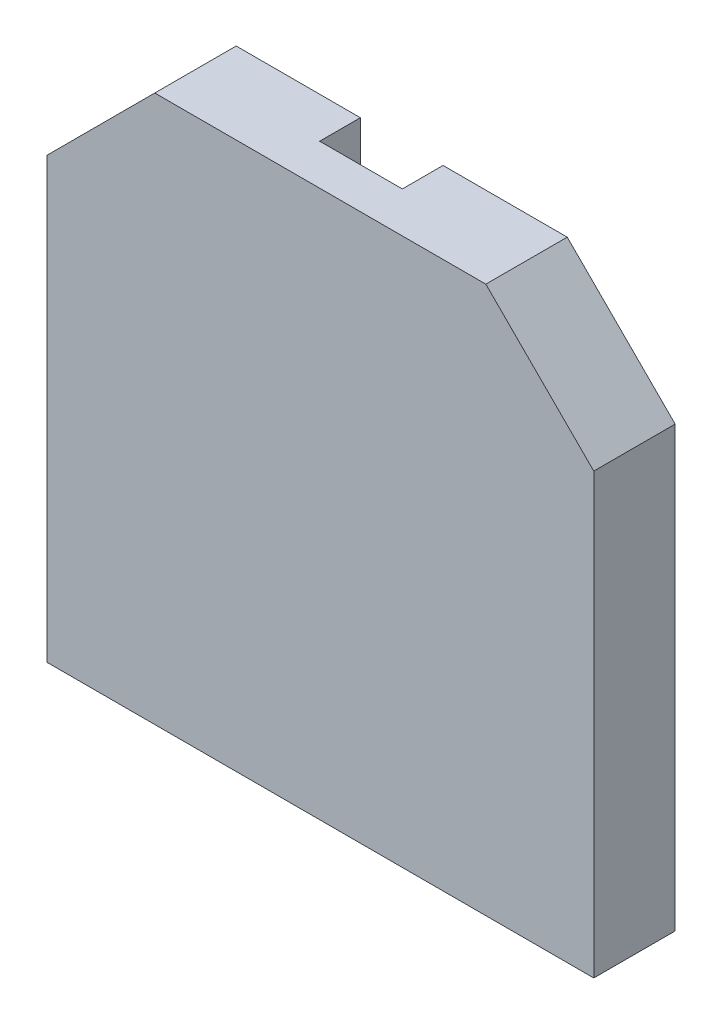
ISO-10303-21;
HEADER;
FILE_DESCRIPTION(('STEP AP214'),'2;1');
FILE_NAME('part.step','',(''),(''),'','','');
FILE_SCHEMA(('AUTOMOTIVE_DESIGN { 1 0 10303 214 1 1 1 1 }'));
ENDSEC;
DATA;
#1=APPLICATION_CONTEXT('core data for automotive mechanical design processes');
#2=APPLICATION_PROTOCOL_DEFINITION('international standard','automotive_design',2000,#1);
#3=PRODUCT_CONTEXT('',#1,'mechanical');
#4=PRODUCT('Part','Part','',(#3));
#5=PRODUCT_RELATED_PRODUCT_CATEGORY('part','',(#4));
#6=PRODUCT_DEFINITION_FORMATION('','',#4);
#7=PRODUCT_DEFINITION_CONTEXT('part definition',#1,'design');
#8=PRODUCT_DEFINITION('design','',#6,#7);
#9=PRODUCT_DEFINITION_SHAPE('','',#8);
#10=(LENGTH_UNIT() NAMED_UNIT(*) SI_UNIT(.MILLI.,.METRE.));
#11=(NAMED_UNIT(*) PLANE_ANGLE_UNIT() SI_UNIT($,.RADIAN.));
#12=(NAMED_UNIT(*) SI_UNIT($,.STERADIAN.) SOLID_ANGLE_UNIT());
#13=UNCERTAINTY_MEASURE_WITH_UNIT(LENGTH_MEASURE(1.E-05),#10,'distance_accuracy_value','');
#14=(GEOMETRIC_REPRESENTATION_CONTEXT(3) GLOBAL_UNCERTAINTY_ASSIGNED_CONTEXT((#13)) GLOBAL_UNIT_ASSIGNED_CONTEXT((#10,
#11,#12)) REPRESENTATION_CONTEXT('',''));
#15=CARTESIAN_POINT('',(0.,0.,0.));
#16=DIRECTION('',(0.,0.,1.));
#17=DIRECTION('',(1.,0.,0.));
#18=AXIS2_PLACEMENT_3D('',#15,#16,#17);
#19=CARTESIAN_POINT('',(-0.32500062,-2.34697524,0.31999936));
#20=DIRECTION('',(0.,0.,-1.));
#21=DIRECTION('',(-1.,0.,0.));
#22=AXIS2_PLACEMENT_3D('',#19,#20,#21);
#23=PLANE('',#22);
#24=DIRECTION('',(0.,1.,0.));
#25=VECTOR('',#24,1.);
#26=CARTESIAN_POINT('',(0.32500062,-4.14280096,0.31999936));
#27=LINE('',#26,#25);
#28=CARTESIAN_POINT('',(0.32500062,-3.9928038,0.31999936));
#29=VERTEX_POINT('',#28);
#30=CARTESIAN_POINT('',(0.32500062,-2.34697524,0.31999936));
#31=VERTEX_POINT('',#30);
#32=EDGE_CURVE('E116',#29,#31,#27,.T.);
#33=ORIENTED_EDGE('',*,*,#32,.F.);
#34=DIRECTION('',(-1.,0.,0.));
#35=VECTOR('',#34,1.);
#36=CARTESIAN_POINT('',(-0.32500062,-3.9928038,0.31999936));
#37=LINE('',#36,#35);
#38=CARTESIAN_POINT('',(-0.32500062,-3.9928038,0.31999936));
#39=VERTEX_POINT('',#38);
#40=EDGE_CURVE('E20',#29,#39,#37,.T.);
#41=ORIENTED_EDGE('',*,*,#40,.T.);
#42=DIRECTION('',(0.,1.,0.));
#43=VECTOR('',#42,1.);
#44=CARTESIAN_POINT('',(-0.32500062,-2.34697524,0.31999936));
#45=LINE('',#44,#43);
#46=CARTESIAN_POINT('',(-0.32500062,-2.34697524,0.31999936));
#47=VERTEX_POINT('',#46);
#48=EDGE_CURVE('E143',#47,#39,#45,.F.);
#49=ORIENTED_EDGE('',*,*,#48,.F.);
#50=DIRECTION('',(1.,0.,0.));
#51=VECTOR('',#50,1.);
#52=CARTESIAN_POINT('',(0.32500062,-2.34697524,0.31999936));
#53=LINE('',#52,#51);
#54=EDGE_CURVE('E132',#31,#47,#53,.F.);
#55=ORIENTED_EDGE('',*,*,#54,.F.);
#56=EDGE_LOOP('',(#33,#41,#49,#55));
#57=FACE_BOUND('',#56,.T.);
#58=ADVANCED_FACE('F17',(#57),#23,.T.);
#59=CARTESIAN_POINT('',(-0.32500062,0.45719746,0.31999936));
#60=DIRECTION('',(0.,0.,-1.));
#61=DIRECTION('',(-1.,0.,0.));
#62=AXIS2_PLACEMENT_3D('',#59,#60,#61);
#63=PLANE('',#62);
#64=DIRECTION('',(0.,1.,0.));
#65=VECTOR('',#64,1.);
#66=CARTESIAN_POINT('',(-0.32500062,0.45719746,0.31999936));
#67=LINE('',#66,#65);
#68=CARTESIAN_POINT('',(-0.32500062,0.30719776,0.31999936));
#69=VERTEX_POINT('',#68);
#70=CARTESIAN_POINT('',(-0.32500062,-1.33862826,0.31999936));
#71=VERTEX_POINT('',#70);
#72=EDGE_CURVE('E146',#69,#71,#67,.F.);
#73=ORIENTED_EDGE('',*,*,#72,.F.);
#74=DIRECTION('',(-1.,0.,0.));
#75=VECTOR('',#74,1.);
#76=CARTESIAN_POINT('',(-0.32500062,0.30719776,0.31999936));
#77=LINE('',#76,#75);
#78=CARTESIAN_POINT('',(0.32500062,0.30719776,0.31999936));
#79=VERTEX_POINT('',#78);
#80=EDGE_CURVE('E128',#69,#79,#77,.F.);
#81=ORIENTED_EDGE('',*,*,#80,.T.);
#82=DIRECTION('',(0.,1.,0.));
#83=VECTOR('',#82,1.);
#84=CARTESIAN_POINT('',(0.32500062,-1.33862826,0.31999936));
#85=LINE('',#84,#83);
#86=CARTESIAN_POINT('',(0.32500062,-1.33862826,0.31999936));
#87=VERTEX_POINT('',#86);
#88=EDGE_CURVE('E159',#87,#79,#85,.T.);
#89=ORIENTED_EDGE('',*,*,#88,.F.);
#90=DIRECTION('',(1.,0.,0.));
#91=VECTOR('',#90,1.);
#92=CARTESIAN_POINT('',(-0.32500062,-1.33862826,0.31999936));
#93=LINE('',#92,#91);
#94=EDGE_CURVE('E151',#71,#87,#93,.T.);
#95=ORIENTED_EDGE('',*,*,#94,.F.);
#96=EDGE_LOOP('',(#73,#81,#89,#95));
#97=FACE_BOUND('',#96,.T.);
#98=ADVANCED_FACE('F265',(#97),#63,.T.);
#99=CARTESIAN_POINT('',(0.32500062,-4.14280096,-1.00000054));
#100=DIRECTION('',(-1.,0.,0.));
#101=DIRECTION('',(0.,0.,1.));
#102=AXIS2_PLACEMENT_3D('',#99,#100,#101);
#103=PLANE('',#102);
#104=DIRECTION('',(0.,1.,0.));
#105=VECTOR('',#104,1.);
#106=CARTESIAN_POINT('',(0.32500062,-0.54133242,0.));
#107=LINE('',#106,#105);
#108=CARTESIAN_POINT('',(0.32500062,-3.9928038,0.));
#109=VERTEX_POINT('',#108);
#110=CARTESIAN_POINT('',(0.32500062,-2.34697524,0.));
#111=VERTEX_POINT('',#110);
#112=EDGE_CURVE('E130',#109,#111,#107,.T.);
#113=ORIENTED_EDGE('',*,*,#112,.F.);
#114=DIRECTION('',(0.,0.,1.));
#115=VECTOR('',#114,1.);
#116=CARTESIAN_POINT('',(0.32500062,-3.9928038,-1.00000054));
#117=LINE('',#116,#115);
#118=EDGE_CURVE('E121',#109,#29,#117,.T.);
#119=ORIENTED_EDGE('',*,*,#118,.T.);
#120=ORIENTED_EDGE('',*,*,#32,.T.);
#121=DIRECTION('',(0.,0.,-1.));
#122=VECTOR('',#121,1.);
#123=CARTESIAN_POINT('',(0.32500062,-2.34697524,-1.00000054));
#124=LINE('',#123,#122);
#125=EDGE_CURVE('E138',#111,#31,#124,.F.);
#126=ORIENTED_EDGE('',*,*,#125,.F.);
#127=EDGE_LOOP('',(#113,#119,#120,#126));
#128=FACE_BOUND('',#127,.T.);
#129=ADVANCED_FACE('F129',(#128),#103,.T.);
#130=CARTESIAN_POINT('',(0.32500062,-2.34697524,-1.00000054));
#131=DIRECTION('',(0.,-1.,0.));
#132=DIRECTION('',(0.,0.,-1.));
#133=AXIS2_PLACEMENT_3D('',#130,#131,#132);
#134=PLANE('',#133);
#135=DIRECTION('',(-1.,0.,0.));
#136=VECTOR('',#135,1.);
#137=CARTESIAN_POINT('',(-2.15000078,-2.34697524,0.));
#138=LINE('',#137,#136);
#139=CARTESIAN_POINT('',(-0.32500062,-2.34697524,0.));
#140=VERTEX_POINT('',#139);
#141=EDGE_CURVE('E165',#111,#140,#138,.T.);
#142=ORIENTED_EDGE('',*,*,#141,.F.);
#143=ORIENTED_EDGE('',*,*,#125,.T.);
#144=ORIENTED_EDGE('',*,*,#54,.T.);
#145=DIRECTION('',(0.,0.,-1.));
#146=VECTOR('',#145,1.);
#147=CARTESIAN_POINT('',(-0.32500062,-2.34697524,-1.00000054));
#148=LINE('',#147,#146);
#149=EDGE_CURVE('E140',#140,#47,#148,.F.);
#150=ORIENTED_EDGE('',*,*,#149,.F.);
#151=EDGE_LOOP('',(#142,#143,#144,#150));
#152=FACE_BOUND('',#151,.T.);
#153=ADVANCED_FACE('F255',(#152),#134,.T.);
#154=CARTESIAN_POINT('',(-0.32500062,-2.34697524,-1.00000054));
#155=DIRECTION('',(1.,0.,0.));
#156=DIRECTION('',(0.,0.,-1.));
#157=AXIS2_PLACEMENT_3D('',#154,#155,#156);
#158=PLANE('',#157);
#159=ORIENTED_EDGE('',*,*,#48,.T.);
#160=DIRECTION('',(0.,0.,-1.));
#161=VECTOR('',#160,1.);
#162=CARTESIAN_POINT('',(-0.32500062,-3.9928038,-1.00000054));
#163=LINE('',#162,#161);
#164=CARTESIAN_POINT('',(-0.32500062,-3.9928038,0.));
#165=VERTEX_POINT('',#164);
#166=EDGE_CURVE('E124',#39,#165,#163,.T.);
#167=ORIENTED_EDGE('',*,*,#166,.T.);
#168=DIRECTION('',(0.,1.,0.));
#169=VECTOR('',#168,1.);
#170=CARTESIAN_POINT('',(-0.32500062,-0.54133242,0.));
#171=LINE('',#170,#169);
#172=EDGE_CURVE('E167',#140,#165,#171,.F.);
#173=ORIENTED_EDGE('',*,*,#172,.F.);
#174=ORIENTED_EDGE('',*,*,#149,.T.);
#175=EDGE_LOOP('',(#159,#167,#173,#174));
#176=FACE_BOUND('',#175,.T.);
#177=ADVANCED_FACE('F253',(#176),#158,.T.);
#178=CARTESIAN_POINT('',(-0.32500062,0.45719746,-1.00000054));
#179=DIRECTION('',(1.,0.,0.));
#180=DIRECTION('',(0.,0.,-1.));
#181=AXIS2_PLACEMENT_3D('',#178,#179,#180);
#182=PLANE('',#181);
#183=DIRECTION('',(0.,1.,0.));
#184=VECTOR('',#183,1.);
#185=CARTESIAN_POINT('',(-0.32500062,-0.54133242,0.));
#186=LINE('',#185,#184);
#187=CARTESIAN_POINT('',(-0.32500062,0.30719776,0.));
#188=VERTEX_POINT('',#187);
#189=CARTESIAN_POINT('',(-0.32500062,-1.33862826,0.));
#190=VERTEX_POINT('',#189);
#191=EDGE_CURVE('E170',#188,#190,#186,.F.);
#192=ORIENTED_EDGE('',*,*,#191,.F.);
#193=DIRECTION('',(0.,0.,-1.));
#194=VECTOR('',#193,1.);
#195=CARTESIAN_POINT('',(-0.32500062,0.30719776,-1.00000054));
#196=LINE('',#195,#194);
#197=EDGE_CURVE('E148',#188,#69,#196,.F.);
#198=ORIENTED_EDGE('',*,*,#197,.T.);
#199=ORIENTED_EDGE('',*,*,#72,.T.);
#200=DIRECTION('',(0.,0.,1.));
#201=VECTOR('',#200,1.);
#202=CARTESIAN_POINT('',(-0.32500062,-1.33862826,-1.00000054));
#203=LINE('',#202,#201);
#204=EDGE_CURVE('E153',#190,#71,#203,.T.);
#205=ORIENTED_EDGE('',*,*,#204,.F.);
#206=EDGE_LOOP('',(#192,#198,#199,#205));
#207=FACE_BOUND('',#206,.T.);
#208=ADVANCED_FACE('F263',(#207),#182,.T.);
#209=CARTESIAN_POINT('',(-0.32500062,-1.33862826,-1.00000054));
#210=DIRECTION('',(0.,1.,0.));
#211=DIRECTION('',(0.,0.,1.));
#212=AXIS2_PLACEMENT_3D('',#209,#210,#211);
#213=PLANE('',#212);
#214=DIRECTION('',(-1.,0.,0.));
#215=VECTOR('',#214,1.);
#216=CARTESIAN_POINT('',(-2.15000078,-1.33862826,0.));
#217=LINE('',#216,#215);
#218=CARTESIAN_POINT('',(0.32500062,-1.33862826,0.));
#219=VERTEX_POINT('',#218);
#220=EDGE_CURVE('E172',#190,#219,#217,.F.);
#221=ORIENTED_EDGE('',*,*,#220,.F.);
#222=ORIENTED_EDGE('',*,*,#204,.T.);
#223=ORIENTED_EDGE('',*,*,#94,.T.);
#224=DIRECTION('',(0.,0.,1.));
#225=VECTOR('',#224,1.);
#226=CARTESIAN_POINT('',(0.32500062,-1.33862826,-1.00000054));
#227=LINE('',#226,#225);
#228=EDGE_CURVE('E156',#219,#87,#227,.T.);
#229=ORIENTED_EDGE('',*,*,#228,.F.);
#230=EDGE_LOOP('',(#221,#222,#223,#229));
#231=FACE_BOUND('',#230,.T.);
#232=ADVANCED_FACE('F289',(#231),#213,.T.);
#233=CARTESIAN_POINT('',(0.32500062,-1.33862826,-1.00000054));
#234=DIRECTION('',(-1.,0.,0.));
#235=DIRECTION('',(0.,0.,1.));
#236=AXIS2_PLACEMENT_3D('',#233,#234,#235);
#237=PLANE('',#236);
#238=ORIENTED_EDGE('',*,*,#88,.T.);
#239=DIRECTION('',(0.,0.,1.));
#240=VECTOR('',#239,1.);
#241=CARTESIAN_POINT('',(0.32500062,0.30719776,-1.00000054));
#242=LINE('',#241,#240);
#243=CARTESIAN_POINT('',(0.32500062,0.30719776,0.));
#244=VERTEX_POINT('',#243);
#245=EDGE_CURVE('E162',#79,#244,#242,.F.);
#246=ORIENTED_EDGE('',*,*,#245,.T.);
#247=DIRECTION('',(0.,1.,0.));
#248=VECTOR('',#247,1.);
#249=CARTESIAN_POINT('',(0.32500062,-0.54133242,0.));
#250=LINE('',#249,#248);
#251=EDGE_CURVE('E174',#219,#244,#250,.T.);
#252=ORIENTED_EDGE('',*,*,#251,.F.);
#253=ORIENTED_EDGE('',*,*,#228,.T.);
#254=EDGE_LOOP('',(#238,#246,#252,#253));
#255=FACE_BOUND('',#254,.T.);
#256=ADVANCED_FACE('F286',(#255),#237,.T.);
#257=CARTESIAN_POINT('',(-2.15000078,-0.54133242,0.));
#258=DIRECTION('',(0.,0.,-1.));
#259=DIRECTION('',(-1.,0.,0.));
#260=AXIS2_PLACEMENT_3D('',#257,#258,#259);
#261=PLANE('',#260);
#262=DIRECTION('',(0.707106781186548,-0.707106781186548,0.));
#263=VECTOR('',#262,1.);
#264=CARTESIAN_POINT('',(2.15000078,-0.54133242,0.));
#265=LINE('',#264,#263);
#266=CARTESIAN_POINT('',(1.3014706,0.30719776,0.));
#267=VERTEX_POINT('',#266);
#268=CARTESIAN_POINT('',(2.15000078,-0.54133242,0.));
#269=VERTEX_POINT('',#268);
#270=EDGE_CURVE('E194',#267,#269,#265,.T.);
#271=ORIENTED_EDGE('',*,*,#270,.T.);
#272=DIRECTION('',(0.,1.,0.));
#273=VECTOR('',#272,1.);
#274=CARTESIAN_POINT('',(2.15000078,-3.9928038,0.));
#275=LINE('',#274,#273);
#276=CARTESIAN_POINT('',(2.15000078,-3.9928038,0.));
#277=VERTEX_POINT('',#276);
#278=EDGE_CURVE('E200',#269,#277,#275,.F.);
#279=ORIENTED_EDGE('',*,*,#278,.T.);
#280=DIRECTION('',(1.,0.,0.));
#281=VECTOR('',#280,1.);
#282=CARTESIAN_POINT('',(-2.15000078,-3.9928038,0.));
#283=LINE('',#282,#281);
#284=EDGE_CURVE('E212',#277,#109,#283,.F.);
#285=ORIENTED_EDGE('',*,*,#284,.T.);
#286=ORIENTED_EDGE('',*,*,#112,.T.);
#287=ORIENTED_EDGE('',*,*,#141,.T.);
#288=ORIENTED_EDGE('',*,*,#172,.T.);
#289=DIRECTION('',(1.,0.,0.));
#290=VECTOR('',#289,1.);
#291=CARTESIAN_POINT('',(-2.15000078,-3.9928038,0.));
#292=LINE('',#291,#290);
#293=CARTESIAN_POINT('',(-2.15000078,-3.9928038,0.));
#294=VERTEX_POINT('',#293);
#295=EDGE_CURVE('E205',#165,#294,#292,.F.);
#296=ORIENTED_EDGE('',*,*,#295,.T.);
#297=DIRECTION('',(0.,1.,0.));
#298=VECTOR('',#297,1.);
#299=CARTESIAN_POINT('',(-2.15000078,-0.54133242,0.));
#300=LINE('',#299,#298);
#301=CARTESIAN_POINT('',(-2.15000078,-0.54133242,0.));
#302=VERTEX_POINT('',#301);
#303=EDGE_CURVE('E177',#294,#302,#300,.T.);
#304=ORIENTED_EDGE('',*,*,#303,.T.);
#305=DIRECTION('',(0.707106781186548,0.707106781186548,0.));
#306=VECTOR('',#305,1.);
#307=CARTESIAN_POINT('',(-1.3014706,0.30719776,0.));
#308=LINE('',#307,#306);
#309=CARTESIAN_POINT('',(-1.3014706,0.30719776,0.));
#310=VERTEX_POINT('',#309);
#311=EDGE_CURVE('E180',#302,#310,#308,.T.);
#312=ORIENTED_EDGE('',*,*,#311,.T.);
#313=DIRECTION('',(1.,0.,0.));
#314=VECTOR('',#313,1.);
#315=CARTESIAN_POINT('',(1.3014706,0.30719776,0.));
#316=LINE('',#315,#314);
#317=EDGE_CURVE('E188',#310,#188,#316,.T.);
#318=ORIENTED_EDGE('',*,*,#317,.T.);
#319=ORIENTED_EDGE('',*,*,#191,.T.);
#320=ORIENTED_EDGE('',*,*,#220,.T.);
#321=ORIENTED_EDGE('',*,*,#251,.T.);
#322=DIRECTION('',(1.,0.,0.));
#323=VECTOR('',#322,1.);
#324=CARTESIAN_POINT('',(1.3014706,0.30719776,0.));
#325=LINE('',#324,#323);
#326=EDGE_CURVE('E191',#244,#267,#325,.T.);
#327=ORIENTED_EDGE('',*,*,#326,.T.);
#328=EDGE_LOOP('',(#271,#279,#285,#286,#287,#288,#296,#304,#312,#318,#319,#320,#321,#327));
#329=FACE_BOUND('',#328,.T.);
#330=ADVANCED_FACE('F248',(#329),#261,.T.);
#331=CARTESIAN_POINT('',(-2.15000078,-0.54133242,0.));
#332=DIRECTION('',(1.,0.,0.));
#333=DIRECTION('',(0.,0.,-1.));
#334=AXIS2_PLACEMENT_3D('',#331,#332,#333);
#335=PLANE('',#334);
#336=DIRECTION('',(0.,1.,0.));
#337=VECTOR('',#336,1.);
#338=CARTESIAN_POINT('',(-2.15000078,-0.54133242,0.64000126));
#339=LINE('',#338,#337);
#340=CARTESIAN_POINT('',(-2.15000078,-3.9928038,0.64000126));
#341=VERTEX_POINT('',#340);
#342=CARTESIAN_POINT('',(-2.15000078,-0.54133242,0.64000126));
#343=VERTEX_POINT('',#342);
#344=EDGE_CURVE('E214',#341,#343,#339,.T.);
#345=ORIENTED_EDGE('',*,*,#344,.T.);
#346=DIRECTION('',(0.,0.,1.));
#347=VECTOR('',#346,1.);
#348=CARTESIAN_POINT('',(-2.15000078,-0.54133242,0.));
#349=LINE('',#348,#347);
#350=EDGE_CURVE('E182',#343,#302,#349,.F.);
#351=ORIENTED_EDGE('',*,*,#350,.T.);
#352=ORIENTED_EDGE('',*,*,#303,.F.);
#353=DIRECTION('',(0.,0.,1.));
#354=VECTOR('',#353,1.);
#355=CARTESIAN_POINT('',(-2.15000078,-3.9928038,0.));
#356=LINE('',#355,#354);
#357=EDGE_CURVE('E208',#294,#341,#356,.T.);
#358=ORIENTED_EDGE('',*,*,#357,.T.);
#359=EDGE_LOOP('',(#345,#351,#352,#358));
#360=FACE_BOUND('',#359,.T.);
#361=ADVANCED_FACE('F245',(#360),#335,.F.);
#362=CARTESIAN_POINT('',(-1.3014706,0.30719776,0.));
#363=DIRECTION('',(0.707106781186548,-0.707106781186548,0.));
#364=DIRECTION('',(0.707106781186548,0.707106781186548,0.));
#365=AXIS2_PLACEMENT_3D('',#362,#363,#364);
#366=PLANE('',#365);
#367=DIRECTION('',(0.707106781186547,0.707106781186548,0.));
#368=VECTOR('',#367,1.);
#369=CARTESIAN_POINT('',(-2.15000078,-0.54133242,0.64000126));
#370=LINE('',#369,#368);
#371=CARTESIAN_POINT('',(-1.3014706,0.30719776,0.64000126));
#372=VERTEX_POINT('',#371);
#373=EDGE_CURVE('E217',#343,#372,#370,.T.);
#374=ORIENTED_EDGE('',*,*,#373,.T.);
#375=DIRECTION('',(0.,0.,-1.));
#376=VECTOR('',#375,1.);
#377=CARTESIAN_POINT('',(-1.3014706,0.30719776,0.));
#378=LINE('',#377,#376);
#379=EDGE_CURVE('E185',#372,#310,#378,.T.);
#380=ORIENTED_EDGE('',*,*,#379,.T.);
#381=ORIENTED_EDGE('',*,*,#311,.F.);
#382=ORIENTED_EDGE('',*,*,#350,.F.);
#383=EDGE_LOOP('',(#374,#380,#381,#382));
#384=FACE_BOUND('',#383,.T.);
#385=ADVANCED_FACE('F243',(#384),#366,.F.);
#386=CARTESIAN_POINT('',(1.3014706,0.30719776,0.));
#387=DIRECTION('',(0.,-1.,0.));
#388=DIRECTION('',(0.,0.,-1.));
#389=AXIS2_PLACEMENT_3D('',#386,#387,#388);
#390=PLANE('',#389);
#391=DIRECTION('',(0.,0.,1.));
#392=VECTOR('',#391,1.);
#393=CARTESIAN_POINT('',(1.3014706,0.30719776,0.));
#394=LINE('',#393,#392);
#395=CARTESIAN_POINT('',(1.3014706,0.30719776,0.64000126));
#396=VERTEX_POINT('',#395);
#397=EDGE_CURVE('E197',#396,#267,#394,.F.);
#398=ORIENTED_EDGE('',*,*,#397,.T.);
#399=ORIENTED_EDGE('',*,*,#326,.F.);
#400=ORIENTED_EDGE('',*,*,#245,.F.);
#401=ORIENTED_EDGE('',*,*,#80,.F.);
#402=ORIENTED_EDGE('',*,*,#197,.F.);
#403=ORIENTED_EDGE('',*,*,#317,.F.);
#404=ORIENTED_EDGE('',*,*,#379,.F.);
#405=DIRECTION('',(-1.,0.,0.));
#406=VECTOR('',#405,1.);
#407=CARTESIAN_POINT('',(-2.15000078,0.30719776,0.64000126));
#408=LINE('',#407,#406);
#409=EDGE_CURVE('E220',#372,#396,#408,.F.);
#410=ORIENTED_EDGE('',*,*,#409,.T.);
#411=EDGE_LOOP('',(#398,#399,#400,#401,#402,#403,#404,#410));
#412=FACE_BOUND('',#411,.T.);
#413=ADVANCED_FACE('F238',(#412),#390,.F.);
#414=CARTESIAN_POINT('',(2.15000078,-0.54133242,0.));
#415=DIRECTION('',(-0.707106781186548,-0.707106781186548,0.));
#416=DIRECTION('',(0.707106781186548,-0.707106781186548,0.));
#417=AXIS2_PLACEMENT_3D('',#414,#415,#416);
#418=PLANE('',#417);
#419=DIRECTION('',(0.707106781186547,-0.707106781186548,0.));
#420=VECTOR('',#419,1.);
#421=CARTESIAN_POINT('',(1.3014706,0.30719776,0.64000126));
#422=LINE('',#421,#420);
#423=CARTESIAN_POINT('',(2.15000078,-0.54133242,0.64000126));
#424=VERTEX_POINT('',#423);
#425=EDGE_CURVE('E223',#396,#424,#422,.T.);
#426=ORIENTED_EDGE('',*,*,#425,.T.);
#427=DIRECTION('',(0.,0.,1.));
#428=VECTOR('',#427,1.);
#429=CARTESIAN_POINT('',(2.15000078,-0.54133242,0.));
#430=LINE('',#429,#428);
#431=EDGE_CURVE('E202',#424,#269,#430,.F.);
#432=ORIENTED_EDGE('',*,*,#431,.T.);
#433=ORIENTED_EDGE('',*,*,#270,.F.);
#434=ORIENTED_EDGE('',*,*,#397,.F.);
#435=EDGE_LOOP('',(#426,#432,#433,#434));
#436=FACE_BOUND('',#435,.T.);
#437=ADVANCED_FACE('F235',(#436),#418,.F.);
#438=CARTESIAN_POINT('',(2.15000078,-3.9928038,0.));
#439=DIRECTION('',(-1.,0.,0.));
#440=DIRECTION('',(0.,0.,1.));
#441=AXIS2_PLACEMENT_3D('',#438,#439,#440);
#442=PLANE('',#441);
#443=DIRECTION('',(0.,1.,0.));
#444=VECTOR('',#443,1.);
#445=CARTESIAN_POINT('',(2.15000078,-0.54133242,0.64000126));
#446=LINE('',#445,#444);
#447=CARTESIAN_POINT('',(2.15000078,-3.9928038,0.64000126));
#448=VERTEX_POINT('',#447);
#449=EDGE_CURVE('E26',#424,#448,#446,.F.);
#450=ORIENTED_EDGE('',*,*,#449,.T.);
#451=DIRECTION('',(0.,0.,1.));
#452=VECTOR('',#451,1.);
#453=CARTESIAN_POINT('',(2.15000078,-3.9928038,0.));
#454=LINE('',#453,#452);
#455=EDGE_CURVE('E34',#448,#277,#454,.F.);
#456=ORIENTED_EDGE('',*,*,#455,.T.);
#457=ORIENTED_EDGE('',*,*,#278,.F.);
#458=ORIENTED_EDGE('',*,*,#431,.F.);
#459=EDGE_LOOP('',(#450,#456,#457,#458));
#460=FACE_BOUND('',#459,.T.);
#461=ADVANCED_FACE('F229',(#460),#442,.F.);
#462=CARTESIAN_POINT('',(-2.15000078,-3.9928038,0.));
#463=DIRECTION('',(0.,1.,0.));
#464=DIRECTION('',(0.,0.,1.));
#465=AXIS2_PLACEMENT_3D('',#462,#463,#464);
#466=PLANE('',#465);
#467=ORIENTED_EDGE('',*,*,#455,.F.);
#468=DIRECTION('',(-1.,0.,0.));
#469=VECTOR('',#468,1.);
#470=CARTESIAN_POINT('',(-2.15000078,-3.9928038,0.64000126));
#471=LINE('',#470,#469);
#472=EDGE_CURVE('E11',#448,#341,#471,.T.);
#473=ORIENTED_EDGE('',*,*,#472,.T.);
#474=ORIENTED_EDGE('',*,*,#357,.F.);
#475=ORIENTED_EDGE('',*,*,#295,.F.);
#476=ORIENTED_EDGE('',*,*,#166,.F.);
#477=ORIENTED_EDGE('',*,*,#40,.F.);
#478=ORIENTED_EDGE('',*,*,#118,.F.);
#479=ORIENTED_EDGE('',*,*,#284,.F.);
#480=EDGE_LOOP('',(#467,#473,#474,#475,#476,#477,#478,#479));
#481=FACE_BOUND('',#480,.T.);
#482=ADVANCED_FACE('F120',(#481),#466,.F.);
#483=CARTESIAN_POINT('',(-2.15000078,-0.54133242,0.64000126));
#484=DIRECTION('',(0.,0.,-1.));
#485=DIRECTION('',(-1.,0.,0.));
#486=AXIS2_PLACEMENT_3D('',#483,#484,#485);
#487=PLANE('',#486);
#488=ORIENTED_EDGE('',*,*,#449,.F.);
#489=ORIENTED_EDGE('',*,*,#425,.F.);
#490=ORIENTED_EDGE('',*,*,#409,.F.);
#491=ORIENTED_EDGE('',*,*,#373,.F.);
#492=ORIENTED_EDGE('',*,*,#344,.F.);
#493=ORIENTED_EDGE('',*,*,#472,.F.);
#494=EDGE_LOOP('',(#488,#489,#490,#491,#492,#493));
#495=FACE_BOUND('',#494,.T.);
#496=ADVANCED_FACE('F232',(#495),#487,.F.);
#497=CLOSED_SHELL('',(#58,#98,#129,#153,#177,#208,#232,#256,#330,#361,#385,#413,#437,#461,#482,#496));
#498=MANIFOLD_SOLID_BREP('B1',#497);
#499=ADVANCED_BREP_SHAPE_REPRESENTATION('',(#18,#498),#14);
#500=SHAPE_DEFINITION_REPRESENTATION(#9,#499);
ENDSEC;
END-ISO-10303-21;
